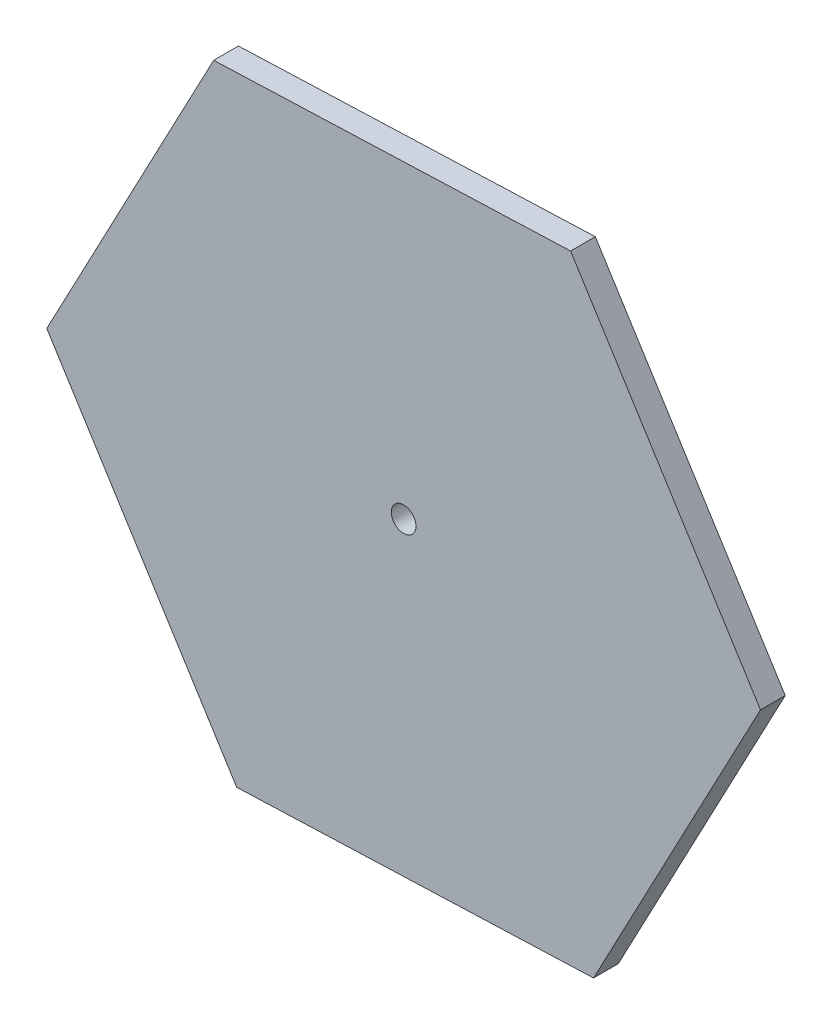
ISO-10303-21;
HEADER;
FILE_DESCRIPTION(('STEP AP214'),'2;1');
FILE_NAME('part.step','',(''),(''),'','','');
FILE_SCHEMA(('AUTOMOTIVE_DESIGN { 1 0 10303 214 1 1 1 1 }'));
ENDSEC;
DATA;
#1=APPLICATION_CONTEXT('core data for automotive mechanical design processes');
#2=APPLICATION_PROTOCOL_DEFINITION('international standard','automotive_design',2000,#1);
#3=PRODUCT_CONTEXT('',#1,'mechanical');
#4=PRODUCT('Part','Part','',(#3));
#5=PRODUCT_RELATED_PRODUCT_CATEGORY('part','',(#4));
#6=PRODUCT_DEFINITION_FORMATION('','',#4);
#7=PRODUCT_DEFINITION_CONTEXT('part definition',#1,'design');
#8=PRODUCT_DEFINITION('design','',#6,#7);
#9=PRODUCT_DEFINITION_SHAPE('','',#8);
#10=(LENGTH_UNIT() NAMED_UNIT(*) SI_UNIT(.MILLI.,.METRE.));
#11=(NAMED_UNIT(*) PLANE_ANGLE_UNIT() SI_UNIT($,.RADIAN.));
#12=(NAMED_UNIT(*) SI_UNIT($,.STERADIAN.) SOLID_ANGLE_UNIT());
#13=UNCERTAINTY_MEASURE_WITH_UNIT(LENGTH_MEASURE(1.E-05),#10,'distance_accuracy_value','');
#14=(GEOMETRIC_REPRESENTATION_CONTEXT(3) GLOBAL_UNCERTAINTY_ASSIGNED_CONTEXT((#13)) GLOBAL_UNIT_ASSIGNED_CONTEXT((#10,
#11,#12)) REPRESENTATION_CONTEXT('',''));
#15=CARTESIAN_POINT('',(0.,0.,0.));
#16=DIRECTION('',(0.,0.,1.));
#17=DIRECTION('',(1.,0.,0.));
#18=AXIS2_PLACEMENT_3D('',#15,#16,#17);
#19=CARTESIAN_POINT('',(-134.944512301537,-255.192695689032,20.));
#20=DIRECTION('',(-0.0371731777492563,0.999308838575954,0.));
#21=DIRECTION('',(-0.999308838575954,-0.0371731777492563,0.));
#22=AXIS2_PLACEMENT_3D('',#19,#20,#21);
#23=PLANE('',#22);
#24=DIRECTION('',(0.999308838575954,0.0371731777492563,0.));
#25=VECTOR('',#24,1.);
#26=CARTESIAN_POINT('',(-134.944512301537,-255.192695689032,0.));
#27=LINE('',#26,#25);
#28=CARTESIAN_POINT('',(-134.944512301537,-255.192695689032,0.));
#29=VERTEX_POINT('',#28);
#30=CARTESIAN_POINT('',(153.531101176165,-244.461723598949,0.));
#31=VERTEX_POINT('',#30);
#32=EDGE_CURVE('E128',#29,#31,#27,.T.);
#33=ORIENTED_EDGE('',*,*,#32,.T.);
#34=DIRECTION('',(0.,0.,-1.));
#35=VECTOR('',#34,1.);
#36=CARTESIAN_POINT('',(153.531101176165,-244.461723598949,20.));
#37=LINE('',#36,#35);
#38=CARTESIAN_POINT('',(153.531101176165,-244.461723598949,20.));
#39=VERTEX_POINT('',#38);
#40=EDGE_CURVE('E11',#39,#31,#37,.T.);
#41=ORIENTED_EDGE('',*,*,#40,.F.);
#42=DIRECTION('',(0.999308838575954,0.0371731777492563,0.));
#43=VECTOR('',#42,1.);
#44=CARTESIAN_POINT('',(-134.944512301537,-255.192695689032,20.));
#45=LINE('',#44,#43);
#46=CARTESIAN_POINT('',(-134.944512301537,-255.192695689032,20.));
#47=VERTEX_POINT('',#46);
#48=EDGE_CURVE('E145',#47,#39,#45,.T.);
#49=ORIENTED_EDGE('',*,*,#48,.F.);
#50=DIRECTION('',(0.,0.,-1.));
#51=VECTOR('',#50,1.);
#52=CARTESIAN_POINT('',(-134.944512301537,-255.192695689032,20.));
#53=LINE('',#52,#51);
#54=EDGE_CURVE('E124',#47,#29,#53,.T.);
#55=ORIENTED_EDGE('',*,*,#54,.T.);
#56=EDGE_LOOP('',(#33,#41,#49,#55));
#57=FACE_BOUND('',#56,.T.);
#58=ADVANCED_FACE('F39',(#57),#23,.F.);
#59=CARTESIAN_POINT('',(153.531101176165,-244.461723598949,20.));
#60=DIRECTION('',(-0.884013429307727,0.467461503017727,0.));
#61=DIRECTION('',(-0.467461503017727,-0.884013429307727,0.));
#62=AXIS2_PLACEMENT_3D('',#59,#60,#61);
#63=PLANE('',#62);
#64=DIRECTION('',(0.467461503017727,0.884013429307727,0.));
#65=VECTOR('',#64,1.);
#66=CARTESIAN_POINT('',(153.531101176165,-244.461723598949,0.));
#67=LINE('',#66,#65);
#68=CARTESIAN_POINT('',(288.475613477702,10.7309720900836,0.));
#69=VERTEX_POINT('',#68);
#70=EDGE_CURVE('E132',#31,#69,#67,.T.);
#71=ORIENTED_EDGE('',*,*,#70,.T.);
#72=DIRECTION('',(0.,0.,-1.));
#73=VECTOR('',#72,1.);
#74=CARTESIAN_POINT('',(288.475613477702,10.7309720900836,20.));
#75=LINE('',#74,#73);
#76=CARTESIAN_POINT('',(288.475613477702,10.7309720900836,20.));
#77=VERTEX_POINT('',#76);
#78=EDGE_CURVE('E48',#77,#69,#75,.T.);
#79=ORIENTED_EDGE('',*,*,#78,.F.);
#80=DIRECTION('',(0.467461503017727,0.884013429307727,0.));
#81=VECTOR('',#80,1.);
#82=CARTESIAN_POINT('',(153.531101176165,-244.461723598949,20.));
#83=LINE('',#82,#81);
#84=EDGE_CURVE('E93',#39,#77,#83,.T.);
#85=ORIENTED_EDGE('',*,*,#84,.F.);
#86=ORIENTED_EDGE('',*,*,#40,.T.);
#87=EDGE_LOOP('',(#71,#79,#85,#86));
#88=FACE_BOUND('',#87,.T.);
#89=ADVANCED_FACE('F174',(#88),#63,.F.);
#90=CARTESIAN_POINT('',(288.475613477702,10.7309720900836,20.));
#91=DIRECTION('',(-0.846840251558471,-0.531847335558227,0.));
#92=DIRECTION('',(0.531847335558227,-0.846840251558471,0.));
#93=AXIS2_PLACEMENT_3D('',#90,#91,#92);
#94=PLANE('',#93);
#95=DIRECTION('',(-0.531847335558227,0.846840251558471,0.));
#96=VECTOR('',#95,1.);
#97=CARTESIAN_POINT('',(288.475613477702,10.7309720900836,0.));
#98=LINE('',#97,#96);
#99=CARTESIAN_POINT('',(134.944512301537,255.192695689032,0.));
#100=VERTEX_POINT('',#99);
#101=EDGE_CURVE('E136',#69,#100,#98,.T.);
#102=ORIENTED_EDGE('',*,*,#101,.T.);
#103=DIRECTION('',(0.,0.,-1.));
#104=VECTOR('',#103,1.);
#105=CARTESIAN_POINT('',(134.944512301537,255.192695689032,20.));
#106=LINE('',#105,#104);
#107=CARTESIAN_POINT('',(134.944512301537,255.192695689032,20.));
#108=VERTEX_POINT('',#107);
#109=EDGE_CURVE('E117',#108,#100,#106,.T.);
#110=ORIENTED_EDGE('',*,*,#109,.F.);
#111=DIRECTION('',(-0.531847335558227,0.846840251558471,0.));
#112=VECTOR('',#111,1.);
#113=CARTESIAN_POINT('',(288.475613477702,10.7309720900836,20.));
#114=LINE('',#113,#112);
#115=EDGE_CURVE('E106',#77,#108,#114,.T.);
#116=ORIENTED_EDGE('',*,*,#115,.F.);
#117=ORIENTED_EDGE('',*,*,#78,.T.);
#118=EDGE_LOOP('',(#102,#110,#116,#117));
#119=FACE_BOUND('',#118,.T.);
#120=ADVANCED_FACE('F155',(#119),#94,.F.);
#121=CARTESIAN_POINT('',(134.944512301537,255.192695689032,20.));
#122=DIRECTION('',(0.0371731777492561,-0.999308838575954,0.));
#123=DIRECTION('',(0.999308838575954,0.0371731777492561,0.));
#124=AXIS2_PLACEMENT_3D('',#121,#122,#123);
#125=PLANE('',#124);
#126=DIRECTION('',(-0.999308838575954,-0.0371731777492561,0.));
#127=VECTOR('',#126,1.);
#128=CARTESIAN_POINT('',(134.944512301537,255.192695689032,0.));
#129=LINE('',#128,#127);
#130=CARTESIAN_POINT('',(-153.531101176165,244.461723598949,0.));
#131=VERTEX_POINT('',#130);
#132=EDGE_CURVE('E115',#100,#131,#129,.T.);
#133=ORIENTED_EDGE('',*,*,#132,.T.);
#134=DIRECTION('',(0.,0.,-1.));
#135=VECTOR('',#134,1.);
#136=CARTESIAN_POINT('',(-153.531101176165,244.461723598949,20.));
#137=LINE('',#136,#135);
#138=CARTESIAN_POINT('',(-153.531101176165,244.461723598949,20.));
#139=VERTEX_POINT('',#138);
#140=EDGE_CURVE('E112',#139,#131,#137,.T.);
#141=ORIENTED_EDGE('',*,*,#140,.F.);
#142=DIRECTION('',(-0.999308838575954,-0.0371731777492561,0.));
#143=VECTOR('',#142,1.);
#144=CARTESIAN_POINT('',(134.944512301537,255.192695689032,20.));
#145=LINE('',#144,#143);
#146=EDGE_CURVE('E100',#108,#139,#145,.T.);
#147=ORIENTED_EDGE('',*,*,#146,.F.);
#148=ORIENTED_EDGE('',*,*,#109,.T.);
#149=EDGE_LOOP('',(#133,#141,#147,#148));
#150=FACE_BOUND('',#149,.T.);
#151=ADVANCED_FACE('F113',(#150),#125,.F.);
#152=CARTESIAN_POINT('',(-153.531101176165,244.461723598949,20.));
#153=DIRECTION('',(0.884013429307727,-0.467461503017726,0.));
#154=DIRECTION('',(0.467461503017727,0.884013429307727,0.));
#155=AXIS2_PLACEMENT_3D('',#152,#153,#154);
#156=PLANE('',#155);
#157=DIRECTION('',(-0.467461503017726,-0.884013429307727,0.));
#158=VECTOR('',#157,1.);
#159=CARTESIAN_POINT('',(-153.531101176165,244.461723598949,0.));
#160=LINE('',#159,#158);
#161=CARTESIAN_POINT('',(-288.475613477702,-10.7309720900837,0.));
#162=VERTEX_POINT('',#161);
#163=EDGE_CURVE('E79',#131,#162,#160,.T.);
#164=ORIENTED_EDGE('',*,*,#163,.T.);
#165=DIRECTION('',(0.,0.,-1.));
#166=VECTOR('',#165,1.);
#167=CARTESIAN_POINT('',(-288.475613477702,-10.7309720900837,20.));
#168=LINE('',#167,#166);
#169=CARTESIAN_POINT('',(-288.475613477702,-10.7309720900837,20.));
#170=VERTEX_POINT('',#169);
#171=EDGE_CURVE('E118',#170,#162,#168,.T.);
#172=ORIENTED_EDGE('',*,*,#171,.F.);
#173=DIRECTION('',(-0.467461503017726,-0.884013429307727,0.));
#174=VECTOR('',#173,1.);
#175=CARTESIAN_POINT('',(-153.531101176165,244.461723598949,20.));
#176=LINE('',#175,#174);
#177=EDGE_CURVE('E104',#139,#170,#176,.T.);
#178=ORIENTED_EDGE('',*,*,#177,.F.);
#179=ORIENTED_EDGE('',*,*,#140,.T.);
#180=EDGE_LOOP('',(#164,#172,#178,#179));
#181=FACE_BOUND('',#180,.T.);
#182=ADVANCED_FACE('F120',(#181),#156,.F.);
#183=CARTESIAN_POINT('',(-288.475613477702,-10.7309720900837,20.));
#184=DIRECTION('',(0.846840251558471,0.531847335558227,0.));
#185=DIRECTION('',(-0.531847335558227,0.846840251558471,0.));
#186=AXIS2_PLACEMENT_3D('',#183,#184,#185);
#187=PLANE('',#186);
#188=DIRECTION('',(0.531847335558227,-0.846840251558471,0.));
#189=VECTOR('',#188,1.);
#190=CARTESIAN_POINT('',(-288.475613477702,-10.7309720900837,0.));
#191=LINE('',#190,#189);
#192=EDGE_CURVE('E85',#162,#29,#191,.T.);
#193=ORIENTED_EDGE('',*,*,#192,.T.);
#194=ORIENTED_EDGE('',*,*,#54,.F.);
#195=DIRECTION('',(0.531847335558227,-0.846840251558471,0.));
#196=VECTOR('',#195,1.);
#197=CARTESIAN_POINT('',(-288.475613477702,-10.7309720900837,20.));
#198=LINE('',#197,#196);
#199=EDGE_CURVE('E56',#170,#47,#198,.T.);
#200=ORIENTED_EDGE('',*,*,#199,.F.);
#201=ORIENTED_EDGE('',*,*,#171,.T.);
#202=EDGE_LOOP('',(#193,#194,#200,#201));
#203=FACE_BOUND('',#202,.T.);
#204=ADVANCED_FACE('F162',(#203),#187,.F.);
#205=CARTESIAN_POINT('',(0.,0.,20.));
#206=DIRECTION('',(0.,0.,1.));
#207=DIRECTION('',(1.,0.,0.));
#208=AXIS2_PLACEMENT_3D('',#205,#206,#207);
#209=PLANE('',#208);
#210=CARTESIAN_POINT('',(0.,0.,20.));
#211=DIRECTION('',(0.,0.,1.));
#212=DIRECTION('',(1.,0.,0.));
#213=AXIS2_PLACEMENT_3D('',#210,#211,#212);
#214=CIRCLE('',#213,10.);
#215=CARTESIAN_POINT('',(10.,0.,20.));
#216=VERTEX_POINT('',#215);
#217=EDGE_CURVE('E229',#216,#216,#214,.T.);
#218=ORIENTED_EDGE('',*,*,#217,.F.);
#219=EDGE_LOOP('',(#218));
#220=FACE_BOUND('',#219,.T.);
#221=ORIENTED_EDGE('',*,*,#48,.T.);
#222=ORIENTED_EDGE('',*,*,#84,.T.);
#223=ORIENTED_EDGE('',*,*,#115,.T.);
#224=ORIENTED_EDGE('',*,*,#146,.T.);
#225=ORIENTED_EDGE('',*,*,#177,.T.);
#226=ORIENTED_EDGE('',*,*,#199,.T.);
#227=EDGE_LOOP('',(#221,#222,#223,#224,#225,#226));
#228=FACE_BOUND('',#227,.T.);
#229=ADVANCED_FACE('F102',(#220,#228),#209,.T.);
#230=CARTESIAN_POINT('',(0.,0.,0.));
#231=DIRECTION('',(0.,0.,1.));
#232=DIRECTION('',(1.,0.,0.));
#233=AXIS2_PLACEMENT_3D('',#230,#231,#232);
#234=PLANE('',#233);
#235=CARTESIAN_POINT('',(0.,0.,0.));
#236=DIRECTION('',(0.,0.,1.));
#237=DIRECTION('',(1.,0.,0.));
#238=AXIS2_PLACEMENT_3D('',#235,#236,#237);
#239=CIRCLE('',#238,10.);
#240=CARTESIAN_POINT('',(10.,0.,0.));
#241=VERTEX_POINT('',#240);
#242=EDGE_CURVE('E133',#241,#241,#239,.T.);
#243=ORIENTED_EDGE('',*,*,#242,.T.);
#244=EDGE_LOOP('',(#243));
#245=FACE_BOUND('',#244,.T.);
#246=ORIENTED_EDGE('',*,*,#32,.F.);
#247=ORIENTED_EDGE('',*,*,#192,.F.);
#248=ORIENTED_EDGE('',*,*,#163,.F.);
#249=ORIENTED_EDGE('',*,*,#132,.F.);
#250=ORIENTED_EDGE('',*,*,#101,.F.);
#251=ORIENTED_EDGE('',*,*,#70,.F.);
#252=EDGE_LOOP('',(#246,#247,#248,#249,#250,#251));
#253=FACE_BOUND('',#252,.T.);
#254=ADVANCED_FACE('F158',(#245,#253),#234,.F.);
#255=CARTESIAN_POINT('',(0.,0.,0.));
#256=DIRECTION('',(0.,0.,1.));
#257=DIRECTION('',(1.,0.,0.));
#258=AXIS2_PLACEMENT_3D('',#255,#256,#257);
#259=CYLINDRICAL_SURFACE('',#258,10.);
#260=ORIENTED_EDGE('',*,*,#242,.F.);
#261=EDGE_LOOP('',(#260));
#262=FACE_BOUND('',#261,.T.);
#263=ORIENTED_EDGE('',*,*,#217,.T.);
#264=EDGE_LOOP('',(#263));
#265=FACE_BOUND('',#264,.T.);
#266=ADVANCED_FACE('F211',(#262,#265),#259,.F.);
#267=CLOSED_SHELL('',(#58,#89,#120,#151,#182,#204,#229,#254,#266));
#268=MANIFOLD_SOLID_BREP('B2',#267);
#269=ADVANCED_BREP_SHAPE_REPRESENTATION('',(#18,#268),#14);
#270=SHAPE_DEFINITION_REPRESENTATION(#9,#269);
ENDSEC;
END-ISO-10303-21;
